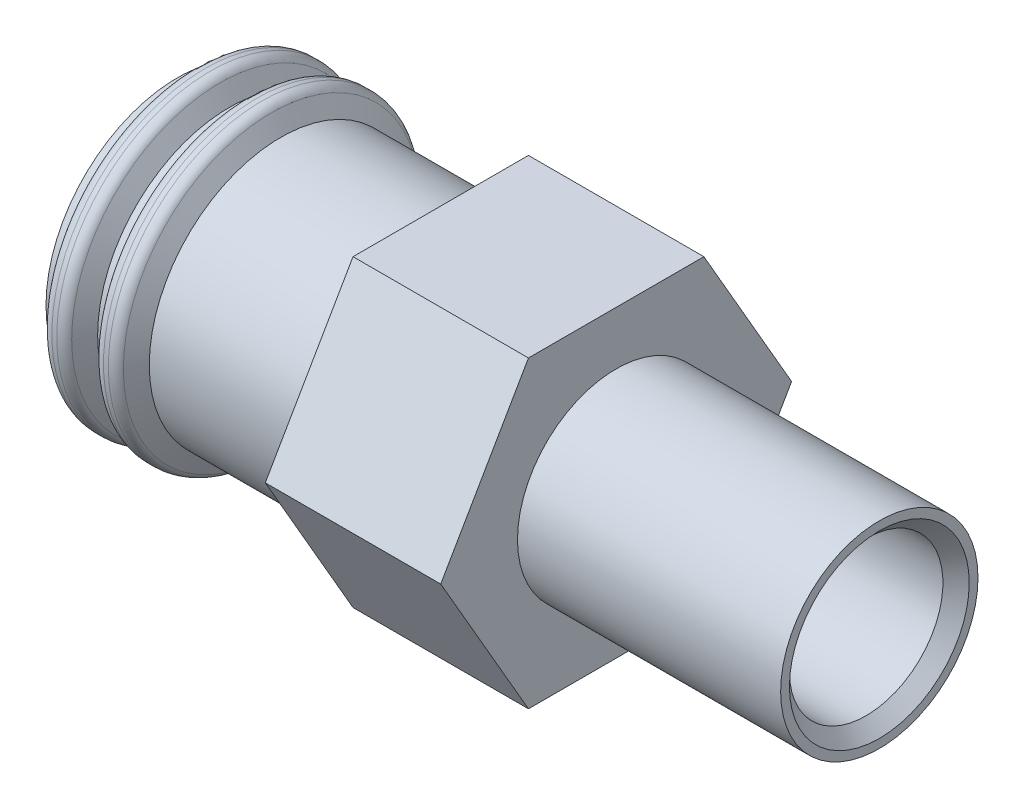
ISO-10303-21;
HEADER;
FILE_DESCRIPTION(('STEP AP214'),'2;1');
FILE_NAME('part.step','',(''),(''),'','','');
FILE_SCHEMA(('AUTOMOTIVE_DESIGN { 1 0 10303 214 1 1 1 1 }'));
ENDSEC;
DATA;
#1=APPLICATION_CONTEXT('core data for automotive mechanical design processes');
#2=APPLICATION_PROTOCOL_DEFINITION('international standard','automotive_design',2000,#1);
#3=PRODUCT_CONTEXT('',#1,'mechanical');
#4=PRODUCT('Part','Part','',(#3));
#5=PRODUCT_RELATED_PRODUCT_CATEGORY('part','',(#4));
#6=PRODUCT_DEFINITION_FORMATION('','',#4);
#7=PRODUCT_DEFINITION_CONTEXT('part definition',#1,'design');
#8=PRODUCT_DEFINITION('design','',#6,#7);
#9=PRODUCT_DEFINITION_SHAPE('','',#8);
#10=(LENGTH_UNIT() NAMED_UNIT(*) SI_UNIT(.MILLI.,.METRE.));
#11=(NAMED_UNIT(*) PLANE_ANGLE_UNIT() SI_UNIT($,.RADIAN.));
#12=(NAMED_UNIT(*) SI_UNIT($,.STERADIAN.) SOLID_ANGLE_UNIT());
#13=UNCERTAINTY_MEASURE_WITH_UNIT(LENGTH_MEASURE(1.E-05),#10,'distance_accuracy_value','');
#14=(GEOMETRIC_REPRESENTATION_CONTEXT(3) GLOBAL_UNCERTAINTY_ASSIGNED_CONTEXT((#13)) GLOBAL_UNIT_ASSIGNED_CONTEXT((#10,
#11,#12)) REPRESENTATION_CONTEXT('',''));
#15=CARTESIAN_POINT('',(0.,0.,0.));
#16=DIRECTION('',(0.,0.,1.));
#17=DIRECTION('',(1.,0.,0.));
#18=AXIS2_PLACEMENT_3D('',#15,#16,#17);
#19=CARTESIAN_POINT('',(1.5,4.,0.));
#20=DIRECTION('',(-1.,0.,0.));
#21=DIRECTION('',(0.,0.,1.));
#22=AXIS2_PLACEMENT_3D('',#19,#20,#21);
#23=PLANE('',#22);
#24=CARTESIAN_POINT('',(1.5,0.,0.));
#25=DIRECTION('',(-1.,0.,0.));
#26=DIRECTION('',(0.,0.,1.));
#27=AXIS2_PLACEMENT_3D('',#24,#25,#26);
#28=CIRCLE('',#27,2.25);
#29=CARTESIAN_POINT('',(1.5,0.,2.25));
#30=VERTEX_POINT('',#29);
#31=EDGE_CURVE('E168',#30,#30,#28,.T.);
#32=ORIENTED_EDGE('',*,*,#31,.T.);
#33=EDGE_LOOP('',(#32));
#34=FACE_BOUND('',#33,.T.);
#35=DIRECTION('',(0.,0.866025403784438,0.500000000000001));
#36=VECTOR('',#35,1.);
#37=CARTESIAN_POINT('',(1.5,1.73205080756888,-3.));
#38=LINE('',#37,#36);
#39=CARTESIAN_POINT('',(1.5,0.,-4.));
#40=VERTEX_POINT('',#39);
#41=CARTESIAN_POINT('',(1.5,3.46410161513776,-1.99999999999999));
#42=VERTEX_POINT('',#41);
#43=EDGE_CURVE('E104',#40,#42,#38,.T.);
#44=ORIENTED_EDGE('',*,*,#43,.T.);
#45=DIRECTION('',(0.,0.,1.));
#46=VECTOR('',#45,1.);
#47=CARTESIAN_POINT('',(1.5,3.46410161513775,0.));
#48=LINE('',#47,#46);
#49=CARTESIAN_POINT('',(1.5,3.46410161513775,2.00000000000002));
#50=VERTEX_POINT('',#49);
#51=EDGE_CURVE('E145',#42,#50,#48,.T.);
#52=ORIENTED_EDGE('',*,*,#51,.T.);
#53=DIRECTION('',(0.,-0.866025403784442,0.499999999999995));
#54=VECTOR('',#53,1.);
#55=CARTESIAN_POINT('',(1.5,1.73205080756886,3.00000000000001));
#56=LINE('',#55,#54);
#57=CARTESIAN_POINT('',(1.5,0.,4.));
#58=VERTEX_POINT('',#57);
#59=EDGE_CURVE('E60',#50,#58,#56,.T.);
#60=ORIENTED_EDGE('',*,*,#59,.T.);
#61=DIRECTION('',(0.,-0.866025403784435,-0.500000000000007));
#62=VECTOR('',#61,1.);
#63=CARTESIAN_POINT('',(1.5,-1.7320508075689,2.99999999999998));
#64=LINE('',#63,#62);
#65=CARTESIAN_POINT('',(1.5,-3.46410161513777,1.99999999999997));
#66=VERTEX_POINT('',#65);
#67=EDGE_CURVE('E69',#58,#66,#64,.T.);
#68=ORIENTED_EDGE('',*,*,#67,.T.);
#69=DIRECTION('',(0.,0.,-1.));
#70=VECTOR('',#69,1.);
#71=CARTESIAN_POINT('',(1.5,-3.46410161513775,0.));
#72=LINE('',#71,#70);
#73=CARTESIAN_POINT('',(1.5,-3.46410161513773,-2.00000000000004));
#74=VERTEX_POINT('',#73);
#75=EDGE_CURVE('E124',#66,#74,#72,.T.);
#76=ORIENTED_EDGE('',*,*,#75,.T.);
#77=DIRECTION('',(0.,0.866025403784442,-0.499999999999995));
#78=VECTOR('',#77,1.);
#79=CARTESIAN_POINT('',(1.5,-1.73205080756887,-3.00000000000002));
#80=LINE('',#79,#78);
#81=EDGE_CURVE('E109',#74,#40,#80,.T.);
#82=ORIENTED_EDGE('',*,*,#81,.T.);
#83=EDGE_LOOP('',(#44,#52,#60,#68,#76,#82));
#84=FACE_BOUND('',#83,.T.);
#85=ADVANCED_FACE('F45',(#34,#84),#23,.F.);
#86=CARTESIAN_POINT('',(-2.5,3.,0.));
#87=DIRECTION('',(1.,0.,0.));
#88=DIRECTION('',(0.,0.,-1.));
#89=AXIS2_PLACEMENT_3D('',#86,#87,#88);
#90=PLANE('',#89);
#91=CARTESIAN_POINT('',(-2.5,0.,0.));
#92=DIRECTION('',(-1.,0.,0.));
#93=DIRECTION('',(0.,0.,1.));
#94=AXIS2_PLACEMENT_3D('',#91,#92,#93);
#95=CIRCLE('',#94,3.);
#96=CARTESIAN_POINT('',(-2.5,0.,3.));
#97=VERTEX_POINT('',#96);
#98=EDGE_CURVE('E165',#97,#97,#95,.T.);
#99=ORIENTED_EDGE('',*,*,#98,.F.);
#100=EDGE_LOOP('',(#99));
#101=FACE_BOUND('',#100,.T.);
#102=DIRECTION('',(0.,0.866025403784438,0.500000000000001));
#103=VECTOR('',#102,1.);
#104=CARTESIAN_POINT('',(-2.5,1.73205080756888,-3.));
#105=LINE('',#104,#103);
#106=CARTESIAN_POINT('',(-2.5,0.,-4.));
#107=VERTEX_POINT('',#106);
#108=CARTESIAN_POINT('',(-2.5,3.46410161513776,-1.99999999999999));
#109=VERTEX_POINT('',#108);
#110=EDGE_CURVE('E101',#107,#109,#105,.T.);
#111=ORIENTED_EDGE('',*,*,#110,.F.);
#112=DIRECTION('',(0.,0.866025403784442,-0.499999999999995));
#113=VECTOR('',#112,1.);
#114=CARTESIAN_POINT('',(-2.5,-1.73205080756887,-3.00000000000002));
#115=LINE('',#114,#113);
#116=CARTESIAN_POINT('',(-2.5,-3.46410161513773,-2.00000000000004));
#117=VERTEX_POINT('',#116);
#118=EDGE_CURVE('E108',#117,#107,#115,.T.);
#119=ORIENTED_EDGE('',*,*,#118,.F.);
#120=DIRECTION('',(0.,0.,-1.));
#121=VECTOR('',#120,1.);
#122=CARTESIAN_POINT('',(-2.5,-3.46410161513775,0.));
#123=LINE('',#122,#121);
#124=CARTESIAN_POINT('',(-2.5,-3.46410161513777,1.99999999999997));
#125=VERTEX_POINT('',#124);
#126=EDGE_CURVE('E130',#125,#117,#123,.T.);
#127=ORIENTED_EDGE('',*,*,#126,.F.);
#128=DIRECTION('',(0.,-0.866025403784435,-0.500000000000007));
#129=VECTOR('',#128,1.);
#130=CARTESIAN_POINT('',(-2.5,-1.7320508075689,2.99999999999998));
#131=LINE('',#130,#129);
#132=CARTESIAN_POINT('',(-2.5,0.,4.));
#133=VERTEX_POINT('',#132);
#134=EDGE_CURVE('E135',#133,#125,#131,.T.);
#135=ORIENTED_EDGE('',*,*,#134,.F.);
#136=DIRECTION('',(0.,-0.866025403784442,0.499999999999995));
#137=VECTOR('',#136,1.);
#138=CARTESIAN_POINT('',(-2.5,1.73205080756886,3.00000000000001));
#139=LINE('',#138,#137);
#140=CARTESIAN_POINT('',(-2.5,3.46410161513775,2.00000000000002));
#141=VERTEX_POINT('',#140);
#142=EDGE_CURVE('E141',#141,#133,#139,.T.);
#143=ORIENTED_EDGE('',*,*,#142,.F.);
#144=DIRECTION('',(0.,0.,1.));
#145=VECTOR('',#144,1.);
#146=CARTESIAN_POINT('',(-2.5,3.46410161513775,0.));
#147=LINE('',#146,#145);
#148=EDGE_CURVE('E119',#109,#141,#147,.T.);
#149=ORIENTED_EDGE('',*,*,#148,.F.);
#150=EDGE_LOOP('',(#111,#119,#127,#135,#143,#149));
#151=FACE_BOUND('',#150,.T.);
#152=ADVANCED_FACE('F114',(#101,#151),#90,.F.);
#153=CARTESIAN_POINT('',(-29.7219053344211,0.,0.));
#154=DIRECTION('',(-1.,0.,0.));
#155=DIRECTION('',(0.,0.,1.));
#156=AXIS2_PLACEMENT_3D('',#153,#154,#155);
#157=CYLINDRICAL_SURFACE('',#156,3.);
#158=CARTESIAN_POINT('',(-8.5,0.,0.));
#159=DIRECTION('',(-1.,0.,0.));
#160=DIRECTION('',(0.,0.,1.));
#161=AXIS2_PLACEMENT_3D('',#158,#159,#160);
#162=CIRCLE('',#161,3.);
#163=CARTESIAN_POINT('',(-8.5,0.,3.));
#164=VERTEX_POINT('',#163);
#165=EDGE_CURVE('E183',#164,#164,#162,.T.);
#166=ORIENTED_EDGE('',*,*,#165,.F.);
#167=EDGE_LOOP('',(#166));
#168=FACE_BOUND('',#167,.T.);
#169=CARTESIAN_POINT('',(-8.3,0.,0.));
#170=DIRECTION('',(-1.,0.,0.));
#171=DIRECTION('',(0.,0.,1.));
#172=AXIS2_PLACEMENT_3D('',#169,#170,#171);
#173=CIRCLE('',#172,3.);
#174=CARTESIAN_POINT('',(-8.3,0.,3.));
#175=VERTEX_POINT('',#174);
#176=EDGE_CURVE('E152',#175,#175,#173,.T.);
#177=ORIENTED_EDGE('',*,*,#176,.T.);
#178=EDGE_LOOP('',(#177));
#179=FACE_BOUND('',#178,.T.);
#180=ADVANCED_FACE('F230',(#168,#179),#157,.T.);
#181=CARTESIAN_POINT('',(-8.5,2.5,0.));
#182=DIRECTION('',(1.,0.,0.));
#183=DIRECTION('',(0.,0.,-1.));
#184=AXIS2_PLACEMENT_3D('',#181,#182,#183);
#185=PLANE('',#184);
#186=CARTESIAN_POINT('',(-8.5,0.,0.));
#187=DIRECTION('',(-1.,0.,0.));
#188=DIRECTION('',(0.,0.,1.));
#189=AXIS2_PLACEMENT_3D('',#186,#187,#188);
#190=CIRCLE('',#189,2.5);
#191=CARTESIAN_POINT('',(-8.5,0.,2.5));
#192=VERTEX_POINT('',#191);
#193=EDGE_CURVE('E180',#192,#192,#190,.T.);
#194=ORIENTED_EDGE('',*,*,#193,.F.);
#195=EDGE_LOOP('',(#194));
#196=FACE_BOUND('',#195,.T.);
#197=ORIENTED_EDGE('',*,*,#165,.T.);
#198=EDGE_LOOP('',(#197));
#199=FACE_BOUND('',#198,.T.);
#200=ADVANCED_FACE('F254',(#196,#199),#185,.F.);
#201=CARTESIAN_POINT('',(-29.7219053344211,0.,0.));
#202=DIRECTION('',(-1.,0.,0.));
#203=DIRECTION('',(0.,0.,1.));
#204=AXIS2_PLACEMENT_3D('',#201,#202,#203);
#205=CYLINDRICAL_SURFACE('',#204,2.5);
#206=CARTESIAN_POINT('',(-4.5,0.,0.));
#207=DIRECTION('',(-1.,0.,0.));
#208=DIRECTION('',(0.,0.,1.));
#209=AXIS2_PLACEMENT_3D('',#206,#207,#208);
#210=CIRCLE('',#209,2.5);
#211=CARTESIAN_POINT('',(-4.5,0.,2.5));
#212=VERTEX_POINT('',#211);
#213=EDGE_CURVE('E177',#212,#212,#210,.T.);
#214=ORIENTED_EDGE('',*,*,#213,.F.);
#215=EDGE_LOOP('',(#214));
#216=FACE_BOUND('',#215,.T.);
#217=ORIENTED_EDGE('',*,*,#193,.T.);
#218=EDGE_LOOP('',(#217));
#219=FACE_BOUND('',#218,.T.);
#220=ADVANCED_FACE('F250',(#216,#219),#205,.F.);
#221=CARTESIAN_POINT('',(-4.5,0.,0.));
#222=DIRECTION('',(-1.,0.,0.));
#223=DIRECTION('',(0.,0.,1.));
#224=AXIS2_PLACEMENT_3D('',#221,#222,#223);
#225=CONICAL_SURFACE('',#224,2.5,0.523598775598292);
#226=CARTESIAN_POINT('',(-3.20096189432332,0.,0.));
#227=DIRECTION('',(-1.,0.,0.));
#228=DIRECTION('',(0.,0.,1.));
#229=AXIS2_PLACEMENT_3D('',#226,#227,#228);
#230=CIRCLE('',#229,1.75);
#231=CARTESIAN_POINT('',(-3.20096189432332,0.,1.75));
#232=VERTEX_POINT('',#231);
#233=EDGE_CURVE('E174',#232,#232,#230,.T.);
#234=ORIENTED_EDGE('',*,*,#233,.F.);
#235=EDGE_LOOP('',(#234));
#236=FACE_BOUND('',#235,.T.);
#237=ORIENTED_EDGE('',*,*,#213,.T.);
#238=EDGE_LOOP('',(#237));
#239=FACE_BOUND('',#238,.T.);
#240=ADVANCED_FACE('F246',(#236,#239),#225,.F.);
#241=CARTESIAN_POINT('',(-29.7219053344211,0.,0.));
#242=DIRECTION('',(-1.,0.,0.));
#243=DIRECTION('',(0.,0.,1.));
#244=AXIS2_PLACEMENT_3D('',#241,#242,#243);
#245=CYLINDRICAL_SURFACE('',#244,1.75);
#246=CARTESIAN_POINT('',(7.2,0.,0.));
#247=DIRECTION('',(-1.,0.,0.));
#248=DIRECTION('',(0.,0.,1.));
#249=AXIS2_PLACEMENT_3D('',#246,#247,#248);
#250=CIRCLE('',#249,1.75);
#251=CARTESIAN_POINT('',(7.2,0.,1.75));
#252=VERTEX_POINT('',#251);
#253=EDGE_CURVE('E12',#252,#252,#250,.F.);
#254=ORIENTED_EDGE('',*,*,#253,.T.);
#255=EDGE_LOOP('',(#254));
#256=FACE_BOUND('',#255,.T.);
#257=ORIENTED_EDGE('',*,*,#233,.T.);
#258=EDGE_LOOP('',(#257));
#259=FACE_BOUND('',#258,.T.);
#260=ADVANCED_FACE('F243',(#256,#259),#245,.F.);
#261=CARTESIAN_POINT('',(7.5,2.25,0.));
#262=DIRECTION('',(-1.,0.,0.));
#263=DIRECTION('',(0.,0.,1.));
#264=AXIS2_PLACEMENT_3D('',#261,#262,#263);
#265=PLANE('',#264);
#266=CARTESIAN_POINT('',(7.5,0.,0.));
#267=DIRECTION('',(-1.,0.,0.));
#268=DIRECTION('',(0.,0.,1.));
#269=AXIS2_PLACEMENT_3D('',#266,#267,#268);
#270=CIRCLE('',#269,2.05);
#271=CARTESIAN_POINT('',(7.5,0.,2.05));
#272=VERTEX_POINT('',#271);
#273=EDGE_CURVE('E53',#272,#272,#270,.T.);
#274=ORIENTED_EDGE('',*,*,#273,.T.);
#275=EDGE_LOOP('',(#274));
#276=FACE_BOUND('',#275,.T.);
#277=CARTESIAN_POINT('',(7.5,0.,0.));
#278=DIRECTION('',(-1.,0.,0.));
#279=DIRECTION('',(0.,0.,1.));
#280=AXIS2_PLACEMENT_3D('',#277,#278,#279);
#281=CIRCLE('',#280,2.25);
#282=CARTESIAN_POINT('',(7.5,0.,2.25));
#283=VERTEX_POINT('',#282);
#284=EDGE_CURVE('E171',#283,#283,#281,.T.);
#285=ORIENTED_EDGE('',*,*,#284,.F.);
#286=EDGE_LOOP('',(#285));
#287=FACE_BOUND('',#286,.T.);
#288=ADVANCED_FACE('F212',(#276,#287),#265,.F.);
#289=CARTESIAN_POINT('',(-29.7219053344211,0.,0.));
#290=DIRECTION('',(-1.,0.,0.));
#291=DIRECTION('',(0.,0.,1.));
#292=AXIS2_PLACEMENT_3D('',#289,#290,#291);
#293=CYLINDRICAL_SURFACE('',#292,2.25);
#294=ORIENTED_EDGE('',*,*,#31,.F.);
#295=EDGE_LOOP('',(#294));
#296=FACE_BOUND('',#295,.T.);
#297=ORIENTED_EDGE('',*,*,#284,.T.);
#298=EDGE_LOOP('',(#297));
#299=FACE_BOUND('',#298,.T.);
#300=ADVANCED_FACE('F236',(#296,#299),#293,.T.);
#301=CARTESIAN_POINT('',(-29.7219053344211,0.,0.));
#302=DIRECTION('',(-1.,0.,0.));
#303=DIRECTION('',(0.,0.,1.));
#304=AXIS2_PLACEMENT_3D('',#301,#302,#303);
#305=CYLINDRICAL_SURFACE('',#304,3.);
#306=CARTESIAN_POINT('',(-6.14529946162075,0.,0.));
#307=DIRECTION('',(-1.,0.,0.));
#308=DIRECTION('',(0.,0.,1.));
#309=AXIS2_PLACEMENT_3D('',#306,#307,#308);
#310=CIRCLE('',#309,3.);
#311=CARTESIAN_POINT('',(-6.14529946162075,0.,3.));
#312=VERTEX_POINT('',#311);
#313=EDGE_CURVE('E162',#312,#312,#310,.T.);
#314=ORIENTED_EDGE('',*,*,#313,.F.);
#315=EDGE_LOOP('',(#314));
#316=FACE_BOUND('',#315,.T.);
#317=ORIENTED_EDGE('',*,*,#98,.T.);
#318=EDGE_LOOP('',(#317));
#319=FACE_BOUND('',#318,.T.);
#320=ADVANCED_FACE('F239',(#316,#319),#305,.T.);
#321=CARTESIAN_POINT('',(-6.14529946162075,0.,0.));
#322=DIRECTION('',(-1.,0.,0.));
#323=DIRECTION('',(0.,0.,1.));
#324=AXIS2_PLACEMENT_3D('',#321,#322,#323);
#325=CONICAL_SURFACE('',#324,3.,1.0471975511966);
#326=CARTESIAN_POINT('',(-6.36180581256686,0.,0.));
#327=DIRECTION('',(1.,0.,0.));
#328=DIRECTION('',(0.,0.,-1.));
#329=AXIS2_PLACEMENT_3D('',#326,#327,#328);
#330=CIRCLE('',#329,3.375);
#331=CARTESIAN_POINT('',(-6.36180581256686,0.,-3.375));
#332=VERTEX_POINT('',#331);
#333=EDGE_CURVE('E207',#332,#332,#330,.T.);
#334=ORIENTED_EDGE('',*,*,#333,.T.);
#335=EDGE_LOOP('',(#334));
#336=FACE_BOUND('',#335,.T.);
#337=ORIENTED_EDGE('',*,*,#313,.T.);
#338=EDGE_LOOP('',(#337));
#339=FACE_BOUND('',#338,.T.);
#340=ADVANCED_FACE('F301',(#336,#339),#325,.T.);
#341=CARTESIAN_POINT('',(-29.7219053344211,0.,0.));
#342=DIRECTION('',(-1.,0.,0.));
#343=DIRECTION('',(0.,0.,1.));
#344=AXIS2_PLACEMENT_3D('',#341,#342,#343);
#345=CYLINDRICAL_SURFACE('',#344,3.5);
#346=CARTESIAN_POINT('',(-6.68963702891815,0.,0.));
#347=DIRECTION('',(1.,0.,0.));
#348=DIRECTION('',(0.,0.,-1.));
#349=AXIS2_PLACEMENT_3D('',#346,#347,#348);
#350=CIRCLE('',#349,3.5);
#351=CARTESIAN_POINT('',(-6.68963702891815,0.,-3.5));
#352=VERTEX_POINT('',#351);
#353=EDGE_CURVE('E204',#352,#352,#350,.T.);
#354=ORIENTED_EDGE('',*,*,#353,.T.);
#355=EDGE_LOOP('',(#354));
#356=FACE_BOUND('',#355,.T.);
#357=CARTESIAN_POINT('',(-6.57831216351297,0.,0.));
#358=DIRECTION('',(1.,0.,0.));
#359=DIRECTION('',(0.,0.,-1.));
#360=AXIS2_PLACEMENT_3D('',#357,#358,#359);
#361=CIRCLE('',#360,3.5);
#362=CARTESIAN_POINT('',(-6.57831216351297,0.,-3.5));
#363=VERTEX_POINT('',#362);
#364=EDGE_CURVE('E201',#363,#363,#361,.F.);
#365=ORIENTED_EDGE('',*,*,#364,.T.);
#366=EDGE_LOOP('',(#365));
#367=FACE_BOUND('',#366,.T.);
#368=ADVANCED_FACE('F282',(#356,#367),#345,.T.);
#369=CARTESIAN_POINT('',(-6.83397459621556,0.,0.));
#370=DIRECTION('',(1.,0.,0.));
#371=DIRECTION('',(0.,0.,-1.));
#372=AXIS2_PLACEMENT_3D('',#369,#370,#371);
#373=CONICAL_SURFACE('',#372,3.5,1.0471975511966);
#374=CARTESIAN_POINT('',(-6.90614337986427,0.,0.));
#375=DIRECTION('',(-1.,0.,0.));
#376=DIRECTION('',(0.,0.,1.));
#377=AXIS2_PLACEMENT_3D('',#374,#375,#376);
#378=CIRCLE('',#377,3.375);
#379=CARTESIAN_POINT('',(-6.90614337986427,0.,3.375));
#380=VERTEX_POINT('',#379);
#381=EDGE_CURVE('E198',#380,#380,#378,.T.);
#382=ORIENTED_EDGE('',*,*,#381,.T.);
#383=EDGE_LOOP('',(#382));
#384=FACE_BOUND('',#383,.T.);
#385=CARTESIAN_POINT('',(-7.12264973081037,0.,0.));
#386=DIRECTION('',(-1.,0.,0.));
#387=DIRECTION('',(0.,0.,1.));
#388=AXIS2_PLACEMENT_3D('',#385,#386,#387);
#389=CIRCLE('',#388,3.);
#390=CARTESIAN_POINT('',(-7.12264973081037,0.,3.));
#391=VERTEX_POINT('',#390);
#392=EDGE_CURVE('E159',#391,#391,#389,.T.);
#393=ORIENTED_EDGE('',*,*,#392,.F.);
#394=EDGE_LOOP('',(#393));
#395=FACE_BOUND('',#394,.T.);
#396=ADVANCED_FACE('F278',(#384,#395),#373,.T.);
#397=CARTESIAN_POINT('',(-29.7219053344211,0.,0.));
#398=DIRECTION('',(-1.,0.,0.));
#399=DIRECTION('',(0.,0.,1.));
#400=AXIS2_PLACEMENT_3D('',#397,#398,#399);
#401=CYLINDRICAL_SURFACE('',#400,3.);
#402=CARTESIAN_POINT('',(-7.32264973081037,0.,0.));
#403=DIRECTION('',(-1.,0.,0.));
#404=DIRECTION('',(0.,0.,1.));
#405=AXIS2_PLACEMENT_3D('',#402,#403,#404);
#406=CIRCLE('',#405,3.);
#407=CARTESIAN_POINT('',(-7.32264973081037,0.,3.));
#408=VERTEX_POINT('',#407);
#409=EDGE_CURVE('E156',#408,#408,#406,.T.);
#410=ORIENTED_EDGE('',*,*,#409,.F.);
#411=EDGE_LOOP('',(#410));
#412=FACE_BOUND('',#411,.T.);
#413=ORIENTED_EDGE('',*,*,#392,.T.);
#414=EDGE_LOOP('',(#413));
#415=FACE_BOUND('',#414,.T.);
#416=ADVANCED_FACE('F281',(#412,#415),#401,.T.);
#417=CARTESIAN_POINT('',(-7.32264973081037,0.,0.));
#418=DIRECTION('',(-1.,0.,0.));
#419=DIRECTION('',(0.,0.,1.));
#420=AXIS2_PLACEMENT_3D('',#417,#418,#419);
#421=CONICAL_SURFACE('',#420,3.,1.0471975511966);
#422=CARTESIAN_POINT('',(-7.53915608175648,0.,0.));
#423=DIRECTION('',(1.,0.,0.));
#424=DIRECTION('',(0.,0.,-1.));
#425=AXIS2_PLACEMENT_3D('',#422,#423,#424);
#426=CIRCLE('',#425,3.375);
#427=CARTESIAN_POINT('',(-7.53915608175648,0.,-3.375));
#428=VERTEX_POINT('',#427);
#429=EDGE_CURVE('E192',#428,#428,#426,.T.);
#430=ORIENTED_EDGE('',*,*,#429,.T.);
#431=EDGE_LOOP('',(#430));
#432=FACE_BOUND('',#431,.T.);
#433=ORIENTED_EDGE('',*,*,#409,.T.);
#434=EDGE_LOOP('',(#433));
#435=FACE_BOUND('',#434,.T.);
#436=ADVANCED_FACE('F287',(#432,#435),#421,.T.);
#437=CARTESIAN_POINT('',(-29.7219053344211,0.,0.));
#438=DIRECTION('',(-1.,0.,0.));
#439=DIRECTION('',(0.,0.,1.));
#440=AXIS2_PLACEMENT_3D('',#437,#438,#439);
#441=CYLINDRICAL_SURFACE('',#440,3.5);
#442=CARTESIAN_POINT('',(-7.75566243270259,0.,0.));
#443=DIRECTION('',(1.,0.,0.));
#444=DIRECTION('',(0.,0.,-1.));
#445=AXIS2_PLACEMENT_3D('',#442,#443,#444);
#446=CIRCLE('',#445,3.5);
#447=CARTESIAN_POINT('',(-7.75566243270259,0.,-3.5));
#448=VERTEX_POINT('',#447);
#449=EDGE_CURVE('E189',#448,#448,#446,.F.);
#450=ORIENTED_EDGE('',*,*,#449,.T.);
#451=EDGE_LOOP('',(#450));
#452=FACE_BOUND('',#451,.T.);
#453=CARTESIAN_POINT('',(-7.86698729810778,0.,0.));
#454=DIRECTION('',(1.,0.,0.));
#455=DIRECTION('',(0.,0.,-1.));
#456=AXIS2_PLACEMENT_3D('',#453,#454,#455);
#457=CIRCLE('',#456,3.5);
#458=CARTESIAN_POINT('',(-7.86698729810778,0.,-3.5));
#459=VERTEX_POINT('',#458);
#460=EDGE_CURVE('E186',#459,#459,#457,.T.);
#461=ORIENTED_EDGE('',*,*,#460,.T.);
#462=EDGE_LOOP('',(#461));
#463=FACE_BOUND('',#462,.T.);
#464=ADVANCED_FACE('F293',(#452,#463),#441,.T.);
#465=CARTESIAN_POINT('',(-8.01132486540518,0.,0.));
#466=DIRECTION('',(1.,0.,0.));
#467=DIRECTION('',(0.,0.,-1.));
#468=AXIS2_PLACEMENT_3D('',#465,#466,#467);
#469=CONICAL_SURFACE('',#468,3.5,1.04719755119659);
#470=CARTESIAN_POINT('',(-8.08349364905389,0.,0.));
#471=DIRECTION('',(-1.,0.,0.));
#472=DIRECTION('',(0.,0.,1.));
#473=AXIS2_PLACEMENT_3D('',#470,#471,#472);
#474=CIRCLE('',#473,3.375);
#475=CARTESIAN_POINT('',(-8.08349364905389,0.,3.375));
#476=VERTEX_POINT('',#475);
#477=EDGE_CURVE('E195',#476,#476,#474,.T.);
#478=ORIENTED_EDGE('',*,*,#477,.T.);
#479=EDGE_LOOP('',(#478));
#480=FACE_BOUND('',#479,.T.);
#481=ORIENTED_EDGE('',*,*,#176,.F.);
#482=EDGE_LOOP('',(#481));
#483=FACE_BOUND('',#482,.T.);
#484=ADVANCED_FACE('F410',(#480,#483),#469,.T.);
#485=CARTESIAN_POINT('',(-2.5,3.46410161513775,0.));
#486=DIRECTION('',(0.,1.,0.));
#487=DIRECTION('',(0.,0.,1.));
#488=AXIS2_PLACEMENT_3D('',#485,#486,#487);
#489=PLANE('',#488);
#490=ORIENTED_EDGE('',*,*,#51,.F.);
#491=DIRECTION('',(1.,0.,0.));
#492=VECTOR('',#491,1.);
#493=CARTESIAN_POINT('',(-2.5,3.46410161513776,-1.99999999999999));
#494=LINE('',#493,#492);
#495=EDGE_CURVE('E147',#109,#42,#494,.T.);
#496=ORIENTED_EDGE('',*,*,#495,.F.);
#497=ORIENTED_EDGE('',*,*,#148,.T.);
#498=DIRECTION('',(1.,0.,0.));
#499=VECTOR('',#498,1.);
#500=CARTESIAN_POINT('',(-2.5,3.46410161513775,2.00000000000002));
#501=LINE('',#500,#499);
#502=EDGE_CURVE('E150',#141,#50,#501,.T.);
#503=ORIENTED_EDGE('',*,*,#502,.T.);
#504=EDGE_LOOP('',(#490,#496,#497,#503));
#505=FACE_BOUND('',#504,.T.);
#506=ADVANCED_FACE('F404',(#505),#489,.T.);
#507=CARTESIAN_POINT('',(-2.5,1.73205080756886,3.00000000000001));
#508=DIRECTION('',(0.,0.499999999999995,0.866025403784442));
#509=DIRECTION('',(0.,-0.866025403784442,0.499999999999995));
#510=AXIS2_PLACEMENT_3D('',#507,#508,#509);
#511=PLANE('',#510);
#512=ORIENTED_EDGE('',*,*,#59,.F.);
#513=ORIENTED_EDGE('',*,*,#502,.F.);
#514=ORIENTED_EDGE('',*,*,#142,.T.);
#515=DIRECTION('',(1.,0.,0.));
#516=VECTOR('',#515,1.);
#517=CARTESIAN_POINT('',(-2.5,0.,4.));
#518=LINE('',#517,#516);
#519=EDGE_CURVE('E139',#133,#58,#518,.T.);
#520=ORIENTED_EDGE('',*,*,#519,.T.);
#521=EDGE_LOOP('',(#512,#513,#514,#520));
#522=FACE_BOUND('',#521,.T.);
#523=ADVANCED_FACE('F409',(#522),#511,.T.);
#524=CARTESIAN_POINT('',(-2.5,-1.7320508075689,2.99999999999998));
#525=DIRECTION('',(0.,-0.500000000000007,0.866025403784435));
#526=DIRECTION('',(0.,-0.866025403784435,-0.500000000000007));
#527=AXIS2_PLACEMENT_3D('',#524,#525,#526);
#528=PLANE('',#527);
#529=ORIENTED_EDGE('',*,*,#67,.F.);
#530=ORIENTED_EDGE('',*,*,#519,.F.);
#531=ORIENTED_EDGE('',*,*,#134,.T.);
#532=DIRECTION('',(1.,0.,0.));
#533=VECTOR('',#532,1.);
#534=CARTESIAN_POINT('',(-2.5,-3.46410161513777,1.99999999999997));
#535=LINE('',#534,#533);
#536=EDGE_CURVE('E133',#125,#66,#535,.T.);
#537=ORIENTED_EDGE('',*,*,#536,.T.);
#538=EDGE_LOOP('',(#529,#530,#531,#537));
#539=FACE_BOUND('',#538,.T.);
#540=ADVANCED_FACE('F421',(#539),#528,.T.);
#541=CARTESIAN_POINT('',(-2.5,-3.46410161513775,0.));
#542=DIRECTION('',(0.,-1.,0.));
#543=DIRECTION('',(0.,0.,-1.));
#544=AXIS2_PLACEMENT_3D('',#541,#542,#543);
#545=PLANE('',#544);
#546=ORIENTED_EDGE('',*,*,#75,.F.);
#547=ORIENTED_EDGE('',*,*,#536,.F.);
#548=ORIENTED_EDGE('',*,*,#126,.T.);
#549=DIRECTION('',(1.,0.,0.));
#550=VECTOR('',#549,1.);
#551=CARTESIAN_POINT('',(-2.5,-3.46410161513773,-2.00000000000004));
#552=LINE('',#551,#550);
#553=EDGE_CURVE('E123',#117,#74,#552,.T.);
#554=ORIENTED_EDGE('',*,*,#553,.T.);
#555=EDGE_LOOP('',(#546,#547,#548,#554));
#556=FACE_BOUND('',#555,.T.);
#557=ADVANCED_FACE('F430',(#556),#545,.T.);
#558=CARTESIAN_POINT('',(-2.5,-1.73205080756887,-3.00000000000002));
#559=DIRECTION('',(0.,-0.499999999999995,-0.866025403784442));
#560=DIRECTION('',(0.,0.866025403784442,-0.499999999999995));
#561=AXIS2_PLACEMENT_3D('',#558,#559,#560);
#562=PLANE('',#561);
#563=ORIENTED_EDGE('',*,*,#81,.F.);
#564=ORIENTED_EDGE('',*,*,#553,.F.);
#565=ORIENTED_EDGE('',*,*,#118,.T.);
#566=DIRECTION('',(1.,0.,0.));
#567=VECTOR('',#566,1.);
#568=CARTESIAN_POINT('',(-2.5,0.,-4.));
#569=LINE('',#568,#567);
#570=EDGE_CURVE('E98',#107,#40,#569,.T.);
#571=ORIENTED_EDGE('',*,*,#570,.T.);
#572=EDGE_LOOP('',(#563,#564,#565,#571));
#573=FACE_BOUND('',#572,.T.);
#574=ADVANCED_FACE('F121',(#573),#562,.T.);
#575=CARTESIAN_POINT('',(-2.5,1.73205080756888,-3.));
#576=DIRECTION('',(0.,0.500000000000001,-0.866025403784438));
#577=DIRECTION('',(0.,0.866025403784438,0.500000000000001));
#578=AXIS2_PLACEMENT_3D('',#575,#576,#577);
#579=PLANE('',#578);
#580=ORIENTED_EDGE('',*,*,#43,.F.);
#581=ORIENTED_EDGE('',*,*,#570,.F.);
#582=ORIENTED_EDGE('',*,*,#110,.T.);
#583=ORIENTED_EDGE('',*,*,#495,.T.);
#584=EDGE_LOOP('',(#580,#581,#582,#583));
#585=FACE_BOUND('',#584,.T.);
#586=ADVANCED_FACE('F100',(#585),#579,.T.);
#587=CARTESIAN_POINT('',(-7.75566243270259,0.,0.));
#588=DIRECTION('',(1.,0.,0.));
#589=DIRECTION('',(0.,0.,-1.));
#590=AXIS2_PLACEMENT_3D('',#587,#588,#589);
#591=TOROIDAL_SURFACE('',#590,3.25,0.25);
#592=ORIENTED_EDGE('',*,*,#429,.F.);
#593=EDGE_LOOP('',(#592));
#594=FACE_BOUND('',#593,.T.);
#595=ORIENTED_EDGE('',*,*,#449,.F.);
#596=EDGE_LOOP('',(#595));
#597=FACE_BOUND('',#596,.T.);
#598=ADVANCED_FACE('F262',(#594,#597),#591,.T.);
#599=CARTESIAN_POINT('',(-7.86698729810778,0.,0.));
#600=DIRECTION('',(1.,0.,0.));
#601=DIRECTION('',(0.,0.,-1.));
#602=AXIS2_PLACEMENT_3D('',#599,#600,#601);
#603=TOROIDAL_SURFACE('',#602,3.25,0.25);
#604=ORIENTED_EDGE('',*,*,#460,.F.);
#605=EDGE_LOOP('',(#604));
#606=FACE_BOUND('',#605,.T.);
#607=ORIENTED_EDGE('',*,*,#477,.F.);
#608=EDGE_LOOP('',(#607));
#609=FACE_BOUND('',#608,.T.);
#610=ADVANCED_FACE('F265',(#606,#609),#603,.T.);
#611=CARTESIAN_POINT('',(-6.68963702891815,0.,0.));
#612=DIRECTION('',(1.,0.,0.));
#613=DIRECTION('',(0.,0.,-1.));
#614=AXIS2_PLACEMENT_3D('',#611,#612,#613);
#615=TOROIDAL_SURFACE('',#614,3.25,0.25);
#616=ORIENTED_EDGE('',*,*,#353,.F.);
#617=EDGE_LOOP('',(#616));
#618=FACE_BOUND('',#617,.T.);
#619=ORIENTED_EDGE('',*,*,#381,.F.);
#620=EDGE_LOOP('',(#619));
#621=FACE_BOUND('',#620,.T.);
#622=ADVANCED_FACE('F221',(#618,#621),#615,.T.);
#623=CARTESIAN_POINT('',(-6.57831216351297,0.,0.));
#624=DIRECTION('',(1.,0.,0.));
#625=DIRECTION('',(0.,0.,-1.));
#626=AXIS2_PLACEMENT_3D('',#623,#624,#625);
#627=TOROIDAL_SURFACE('',#626,3.25,0.25);
#628=ORIENTED_EDGE('',*,*,#333,.F.);
#629=EDGE_LOOP('',(#628));
#630=FACE_BOUND('',#629,.T.);
#631=ORIENTED_EDGE('',*,*,#364,.F.);
#632=EDGE_LOOP('',(#631));
#633=FACE_BOUND('',#632,.T.);
#634=ADVANCED_FACE('F216',(#630,#633),#627,.T.);
#635=CARTESIAN_POINT('',(7.5,0.,0.));
#636=DIRECTION('',(1.,0.,0.));
#637=DIRECTION('',(0.,0.,-1.));
#638=AXIS2_PLACEMENT_3D('',#635,#636,#637);
#639=CONICAL_SURFACE('',#638,2.05,0.785398163397445);
#640=ORIENTED_EDGE('',*,*,#253,.F.);
#641=EDGE_LOOP('',(#640));
#642=FACE_BOUND('',#641,.T.);
#643=ORIENTED_EDGE('',*,*,#273,.F.);
#644=EDGE_LOOP('',(#643));
#645=FACE_BOUND('',#644,.T.);
#646=ADVANCED_FACE('F47',(#642,#645),#639,.F.);
#647=CLOSED_SHELL('',(#85,#152,#180,#200,#220,#240,#260,#288,#300,#320,#340,#368,#396,#416,#436,
#464,#484,#506,#523,#540,#557,#574,#586,#598,#610,#622,#634,#646));
#648=MANIFOLD_SOLID_BREP('B2',#647);
#649=ADVANCED_BREP_SHAPE_REPRESENTATION('',(#18,#648),#14);
#650=SHAPE_DEFINITION_REPRESENTATION(#9,#649);
ENDSEC;
END-ISO-10303-21;
